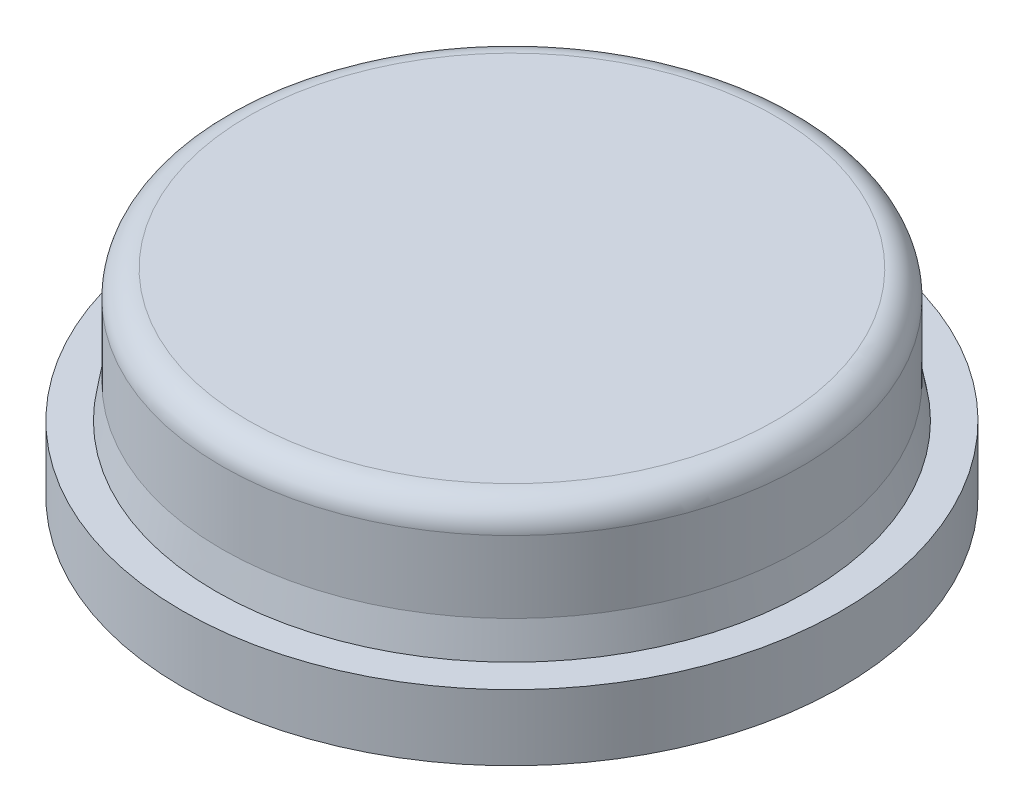
ISO-10303-21;
HEADER;
FILE_DESCRIPTION(('STEP AP214'),'2;1');
FILE_NAME('part.step','',(''),(''),'','','');
FILE_SCHEMA(('AUTOMOTIVE_DESIGN { 1 0 10303 214 1 1 1 1 }'));
ENDSEC;
DATA;
#1=APPLICATION_CONTEXT('core data for automotive mechanical design processes');
#2=APPLICATION_PROTOCOL_DEFINITION('international standard','automotive_design',2000,#1);
#3=PRODUCT_CONTEXT('',#1,'mechanical');
#4=PRODUCT('Part','Part','',(#3));
#5=PRODUCT_RELATED_PRODUCT_CATEGORY('part','',(#4));
#6=PRODUCT_DEFINITION_FORMATION('','',#4);
#7=PRODUCT_DEFINITION_CONTEXT('part definition',#1,'design');
#8=PRODUCT_DEFINITION('design','',#6,#7);
#9=PRODUCT_DEFINITION_SHAPE('','',#8);
#10=(LENGTH_UNIT() NAMED_UNIT(*) SI_UNIT(.MILLI.,.METRE.));
#11=(NAMED_UNIT(*) PLANE_ANGLE_UNIT() SI_UNIT($,.RADIAN.));
#12=(NAMED_UNIT(*) SI_UNIT($,.STERADIAN.) SOLID_ANGLE_UNIT());
#13=UNCERTAINTY_MEASURE_WITH_UNIT(LENGTH_MEASURE(1.E-05),#10,'distance_accuracy_value','');
#14=(GEOMETRIC_REPRESENTATION_CONTEXT(3) GLOBAL_UNCERTAINTY_ASSIGNED_CONTEXT((#13)) GLOBAL_UNIT_ASSIGNED_CONTEXT((#10,
#11,#12)) REPRESENTATION_CONTEXT('',''));
#15=CARTESIAN_POINT('',(0.,0.,0.));
#16=DIRECTION('',(0.,0.,1.));
#17=DIRECTION('',(1.,0.,0.));
#18=AXIS2_PLACEMENT_3D('',#15,#16,#17);
#19=CARTESIAN_POINT('',(0.,1.,0.));
#20=DIRECTION('',(0.,-1.,0.));
#21=DIRECTION('',(0.,0.,-1.));
#22=AXIS2_PLACEMENT_3D('',#19,#20,#21);
#23=CYLINDRICAL_SURFACE('',#22,5.);
#24=CARTESIAN_POINT('',(0.,1.,0.));
#25=DIRECTION('',(0.,1.,0.));
#26=DIRECTION('',(0.,0.,1.));
#27=AXIS2_PLACEMENT_3D('',#24,#25,#26);
#28=CIRCLE('',#27,5.);
#29=CARTESIAN_POINT('',(0.,1.,5.));
#30=VERTEX_POINT('',#29);
#31=EDGE_CURVE('E58',#30,#30,#28,.T.);
#32=ORIENTED_EDGE('',*,*,#31,.F.);
#33=EDGE_LOOP('',(#32));
#34=FACE_BOUND('',#33,.T.);
#35=CARTESIAN_POINT('',(0.,0.,0.));
#36=DIRECTION('',(0.,1.,0.));
#37=DIRECTION('',(0.,0.,1.));
#38=AXIS2_PLACEMENT_3D('',#35,#36,#37);
#39=CIRCLE('',#38,5.);
#40=CARTESIAN_POINT('',(0.,0.,5.));
#41=VERTEX_POINT('',#40);
#42=EDGE_CURVE('E59',#41,#41,#39,.T.);
#43=ORIENTED_EDGE('',*,*,#42,.T.);
#44=EDGE_LOOP('',(#43));
#45=FACE_BOUND('',#44,.T.);
#46=ADVANCED_FACE('F38',(#34,#45),#23,.T.);
#47=CARTESIAN_POINT('',(0.,1.,0.));
#48=DIRECTION('',(0.,1.,0.));
#49=DIRECTION('',(0.,0.,1.));
#50=AXIS2_PLACEMENT_3D('',#47,#48,#49);
#51=PLANE('',#50);
#52=CARTESIAN_POINT('',(0.,1.,0.));
#53=DIRECTION('',(0.,1.,0.));
#54=DIRECTION('',(0.,0.,1.));
#55=AXIS2_PLACEMENT_3D('',#52,#53,#54);
#56=CIRCLE('',#55,4.49000000000001);
#57=CARTESIAN_POINT('',(0.,1.,4.49000000000001));
#58=VERTEX_POINT('',#57);
#59=EDGE_CURVE('E11',#58,#58,#56,.F.);
#60=ORIENTED_EDGE('',*,*,#59,.T.);
#61=EDGE_LOOP('',(#60));
#62=FACE_BOUND('',#61,.T.);
#63=ORIENTED_EDGE('',*,*,#31,.T.);
#64=EDGE_LOOP('',(#63));
#65=FACE_BOUND('',#64,.T.);
#66=ADVANCED_FACE('F78',(#62,#65),#51,.T.);
#67=CARTESIAN_POINT('',(0.,0.,0.));
#68=DIRECTION('',(0.,1.,0.));
#69=DIRECTION('',(0.,0.,1.));
#70=AXIS2_PLACEMENT_3D('',#67,#68,#69);
#71=PLANE('',#70);
#72=CARTESIAN_POINT('',(0.,0.,0.));
#73=DIRECTION('',(0.,-1.,0.));
#74=DIRECTION('',(0.,0.,-1.));
#75=AXIS2_PLACEMENT_3D('',#72,#73,#74);
#76=CIRCLE('',#75,1.65);
#77=CARTESIAN_POINT('',(0.,0.,-1.65));
#78=VERTEX_POINT('',#77);
#79=EDGE_CURVE('E67',#78,#78,#76,.T.);
#80=ORIENTED_EDGE('',*,*,#79,.F.);
#81=EDGE_LOOP('',(#80));
#82=FACE_BOUND('',#81,.T.);
#83=ORIENTED_EDGE('',*,*,#42,.F.);
#84=EDGE_LOOP('',(#83));
#85=FACE_BOUND('',#84,.T.);
#86=ADVANCED_FACE('F74',(#82,#85),#71,.F.);
#87=CARTESIAN_POINT('',(0.,3.,0.));
#88=DIRECTION('',(0.,-1.,0.));
#89=DIRECTION('',(0.,0.,-1.));
#90=AXIS2_PLACEMENT_3D('',#87,#88,#89);
#91=CYLINDRICAL_SURFACE('',#90,4.4);
#92=CARTESIAN_POINT('',(0.,1.51041536376564,0.));
#93=DIRECTION('',(0.,1.,0.));
#94=DIRECTION('',(0.,0.,1.));
#95=AXIS2_PLACEMENT_3D('',#92,#93,#94);
#96=CIRCLE('',#95,4.4);
#97=CARTESIAN_POINT('',(0.,1.51041536376564,4.4));
#98=VERTEX_POINT('',#97);
#99=EDGE_CURVE('E45',#98,#98,#96,.T.);
#100=ORIENTED_EDGE('',*,*,#99,.T.);
#101=EDGE_LOOP('',(#100));
#102=FACE_BOUND('',#101,.T.);
#103=CARTESIAN_POINT('',(0.,2.6,0.));
#104=DIRECTION('',(0.,1.,0.));
#105=DIRECTION('',(0.,0.,1.));
#106=AXIS2_PLACEMENT_3D('',#103,#104,#105);
#107=CIRCLE('',#106,4.4);
#108=CARTESIAN_POINT('',(0.,2.6,4.4));
#109=VERTEX_POINT('',#108);
#110=EDGE_CURVE('E49',#109,#109,#107,.F.);
#111=ORIENTED_EDGE('',*,*,#110,.T.);
#112=EDGE_LOOP('',(#111));
#113=FACE_BOUND('',#112,.T.);
#114=ADVANCED_FACE('F77',(#102,#113),#91,.T.);
#115=CARTESIAN_POINT('',(0.,3.,0.));
#116=DIRECTION('',(0.,1.,0.));
#117=DIRECTION('',(0.,0.,1.));
#118=AXIS2_PLACEMENT_3D('',#115,#116,#117);
#119=PLANE('',#118);
#120=CARTESIAN_POINT('',(0.,3.,0.));
#121=DIRECTION('',(0.,1.,0.));
#122=DIRECTION('',(0.,0.,1.));
#123=AXIS2_PLACEMENT_3D('',#120,#121,#122);
#124=CIRCLE('',#123,4.);
#125=CARTESIAN_POINT('',(0.,3.,4.));
#126=VERTEX_POINT('',#125);
#127=EDGE_CURVE('E53',#126,#126,#124,.T.);
#128=ORIENTED_EDGE('',*,*,#127,.T.);
#129=EDGE_LOOP('',(#128));
#130=FACE_BOUND('',#129,.T.);
#131=ADVANCED_FACE('F92',(#130),#119,.T.);
#132=CARTESIAN_POINT('',(0.,2.6,0.));
#133=DIRECTION('',(0.,1.,0.));
#134=DIRECTION('',(0.,0.,1.));
#135=AXIS2_PLACEMENT_3D('',#132,#133,#134);
#136=TOROIDAL_SURFACE('',#135,4.,0.4);
#137=ORIENTED_EDGE('',*,*,#110,.F.);
#138=EDGE_LOOP('',(#137));
#139=FACE_BOUND('',#138,.T.);
#140=ORIENTED_EDGE('',*,*,#127,.F.);
#141=EDGE_LOOP('',(#140));
#142=FACE_BOUND('',#141,.T.);
#143=ADVANCED_FACE('F90',(#139,#142),#136,.T.);
#144=CARTESIAN_POINT('',(0.,1.51041536376564,0.));
#145=DIRECTION('',(0.,-1.,0.));
#146=DIRECTION('',(0.,0.,-1.));
#147=AXIS2_PLACEMENT_3D('',#144,#145,#146);
#148=CONICAL_SURFACE('',#147,4.4,0.174532925199426);
#149=ORIENTED_EDGE('',*,*,#59,.F.);
#150=EDGE_LOOP('',(#149));
#151=FACE_BOUND('',#150,.T.);
#152=ORIENTED_EDGE('',*,*,#99,.F.);
#153=EDGE_LOOP('',(#152));
#154=FACE_BOUND('',#153,.T.);
#155=ADVANCED_FACE('F40',(#151,#154),#148,.T.);
#156=CARTESIAN_POINT('',(0.,1.65,0.));
#157=DIRECTION('',(0.,1.,0.));
#158=DIRECTION('',(0.,0.,1.));
#159=AXIS2_PLACEMENT_3D('',#156,#157,#158);
#160=PLANE('',#159);
#161=CARTESIAN_POINT('',(0.,1.65,0.));
#162=DIRECTION('',(0.,1.,0.));
#163=DIRECTION('',(0.,0.,1.));
#164=AXIS2_PLACEMENT_3D('',#161,#162,#163);
#165=CIRCLE('',#164,1.65);
#166=CARTESIAN_POINT('',(0.,1.65,1.65));
#167=VERTEX_POINT('',#166);
#168=EDGE_CURVE('E62',#167,#167,#165,.F.);
#169=ORIENTED_EDGE('',*,*,#168,.T.);
#170=EDGE_LOOP('',(#169));
#171=FACE_BOUND('',#170,.T.);
#172=ADVANCED_FACE('F98',(#171),#160,.F.);
#173=CARTESIAN_POINT('',(0.,7.66690475583121,0.));
#174=DIRECTION('',(0.,-1.,0.));
#175=DIRECTION('',(0.,0.,-1.));
#176=AXIS2_PLACEMENT_3D('',#173,#174,#175);
#177=CYLINDRICAL_SURFACE('',#176,1.65);
#178=ORIENTED_EDGE('',*,*,#79,.T.);
#179=EDGE_LOOP('',(#178));
#180=FACE_BOUND('',#179,.T.);
#181=ORIENTED_EDGE('',*,*,#168,.F.);
#182=EDGE_LOOP('',(#181));
#183=FACE_BOUND('',#182,.T.);
#184=ADVANCED_FACE('F71',(#180,#183),#177,.F.);
#185=CLOSED_SHELL('',(#46,#66,#86,#114,#131,#143,#155,#172,#184));
#186=MANIFOLD_SOLID_BREP('B2',#185);
#187=ADVANCED_BREP_SHAPE_REPRESENTATION('',(#18,#186),#14);
#188=SHAPE_DEFINITION_REPRESENTATION(#9,#187);
ENDSEC;
END-ISO-10303-21;
